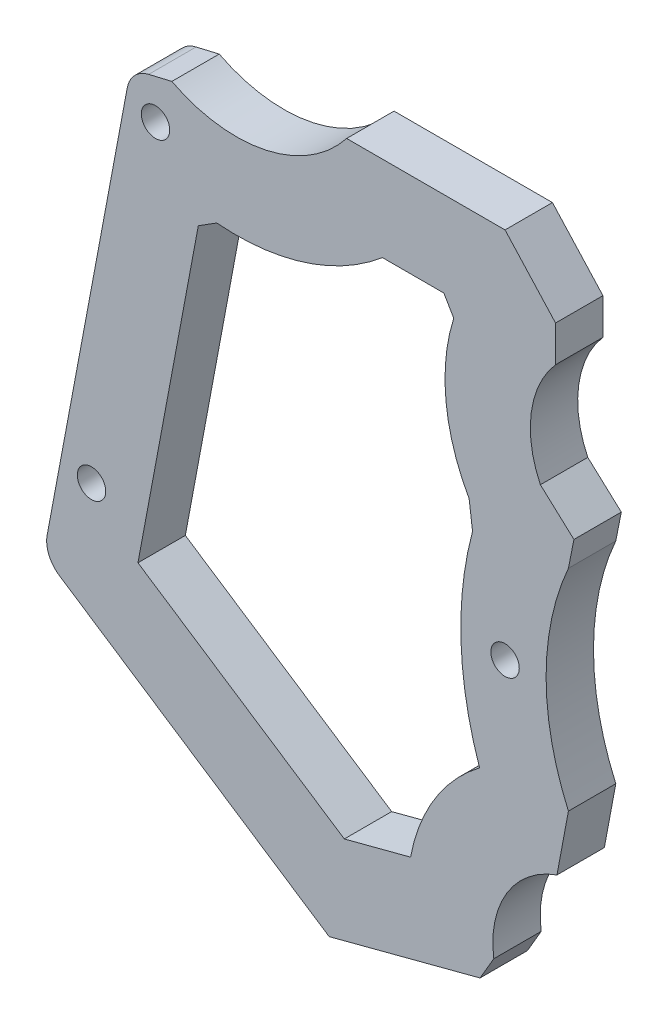
ISO-10303-21;
HEADER;
FILE_DESCRIPTION(('STEP AP214'),'2;1');
FILE_NAME('part.step','',(''),(''),'','','');
FILE_SCHEMA(('AUTOMOTIVE_DESIGN { 1 0 10303 214 1 1 1 1 }'));
ENDSEC;
DATA;
#1=APPLICATION_CONTEXT('core data for automotive mechanical design processes');
#2=APPLICATION_PROTOCOL_DEFINITION('international standard','automotive_design',2000,#1);
#3=PRODUCT_CONTEXT('',#1,'mechanical');
#4=PRODUCT('Part','Part','',(#3));
#5=PRODUCT_RELATED_PRODUCT_CATEGORY('part','',(#4));
#6=PRODUCT_DEFINITION_FORMATION('','',#4);
#7=PRODUCT_DEFINITION_CONTEXT('part definition',#1,'design');
#8=PRODUCT_DEFINITION('design','',#6,#7);
#9=PRODUCT_DEFINITION_SHAPE('','',#8);
#10=(LENGTH_UNIT() NAMED_UNIT(*) SI_UNIT(.MILLI.,.METRE.));
#11=(NAMED_UNIT(*) PLANE_ANGLE_UNIT() SI_UNIT($,.RADIAN.));
#12=(NAMED_UNIT(*) SI_UNIT($,.STERADIAN.) SOLID_ANGLE_UNIT());
#13=UNCERTAINTY_MEASURE_WITH_UNIT(LENGTH_MEASURE(1.E-05),#10,'distance_accuracy_value','');
#14=(GEOMETRIC_REPRESENTATION_CONTEXT(3) GLOBAL_UNCERTAINTY_ASSIGNED_CONTEXT((#13)) GLOBAL_UNIT_ASSIGNED_CONTEXT((#10,
#11,#12)) REPRESENTATION_CONTEXT('',''));
#15=CARTESIAN_POINT('',(0.,0.,0.));
#16=DIRECTION('',(0.,0.,1.));
#17=DIRECTION('',(1.,0.,0.));
#18=AXIS2_PLACEMENT_3D('',#15,#16,#17);
#19=CARTESIAN_POINT('',(45.7521152599476,-57.1963049716079,-24.5));
#20=DIRECTION('',(0.,0.,-1.));
#21=DIRECTION('',(-1.,0.,0.));
#22=AXIS2_PLACEMENT_3D('',#19,#20,#21);
#23=PLANE('',#22);
#24=CARTESIAN_POINT('',(-6.75260699696157,-36.3785967121409,-24.5));
#25=DIRECTION('',(0.,0.,1.));
#26=DIRECTION('',(1.,0.,0.));
#27=AXIS2_PLACEMENT_3D('',#24,#25,#26);
#28=CIRCLE('',#27,1.5);
#29=CARTESIAN_POINT('',(-5.25260699696157,-36.3785967121409,-24.5));
#30=VERTEX_POINT('',#29);
#31=EDGE_CURVE('E355',#30,#30,#28,.T.);
#32=ORIENTED_EDGE('',*,*,#31,.F.);
#33=EDGE_LOOP('',(#32));
#34=FACE_BOUND('',#33,.T.);
#35=CARTESIAN_POINT('',(36.8820128478495,-30.7199793016053,-24.5));
#36=DIRECTION('',(0.,0.,1.));
#37=DIRECTION('',(1.,0.,0.));
#38=AXIS2_PLACEMENT_3D('',#35,#36,#37);
#39=CIRCLE('',#38,1.5);
#40=CARTESIAN_POINT('',(38.3820128478495,-30.7199793016053,-24.5));
#41=VERTEX_POINT('',#40);
#42=EDGE_CURVE('E363',#41,#41,#39,.T.);
#43=ORIENTED_EDGE('',*,*,#42,.F.);
#44=EDGE_LOOP('',(#43));
#45=FACE_BOUND('',#44,.T.);
#46=CARTESIAN_POINT('',(0.,0.,-24.5));
#47=DIRECTION('',(0.,0.,1.));
#48=DIRECTION('',(1.,0.,0.));
#49=AXIS2_PLACEMENT_3D('',#46,#47,#48);
#50=CIRCLE('',#49,1.5);
#51=CARTESIAN_POINT('',(1.5,0.,-24.5));
#52=VERTEX_POINT('',#51);
#53=EDGE_CURVE('E371',#52,#52,#50,.T.);
#54=ORIENTED_EDGE('',*,*,#53,.F.);
#55=EDGE_LOOP('',(#54));
#56=FACE_BOUND('',#55,.T.);
#57=DIRECTION('',(0.967214376255356,0.2539613166704,0.));
#58=VECTOR('',#57,1.);
#59=CARTESIAN_POINT('',(18.3220080047089,-65.2757183813327,-24.5));
#60=LINE('',#59,#58);
#61=CARTESIAN_POINT('',(18.3220080047089,-65.2757183813327,-24.5));
#62=VERTEX_POINT('',#61);
#63=CARTESIAN_POINT('',(34.2420854292445,-61.0955863201418,-24.5));
#64=VERTEX_POINT('',#63);
#65=EDGE_CURVE('E391',#62,#64,#60,.T.);
#66=ORIENTED_EDGE('',*,*,#65,.T.);
#67=DIRECTION('',(-0.504346075134577,-0.863501613487982,0.));
#68=VECTOR('',#67,1.);
#69=CARTESIAN_POINT('',(35.692798529907,-58.6117896477953,-24.5));
#70=LINE('',#69,#68);
#71=CARTESIAN_POINT('',(35.692798529907,-58.6117896477953,-24.5));
#72=VERTEX_POINT('',#71);
#73=EDGE_CURVE('E11',#64,#72,#70,.F.);
#74=ORIENTED_EDGE('',*,*,#73,.T.);
#75=CARTESIAN_POINT('',(45.7521152599476,-57.1963049716079,-24.5));
#76=DIRECTION('',(0.,0.,-1.));
#77=DIRECTION('',(-1.,0.,0.));
#78=AXIS2_PLACEMENT_3D('',#75,#76,#77);
#79=CIRCLE('',#78,10.1584176889807);
#80=CARTESIAN_POINT('',(42.3607565447545,-47.6207038934154,-24.5));
#81=VERTEX_POINT('',#80);
#82=EDGE_CURVE('E394',#72,#81,#79,.T.);
#83=ORIENTED_EDGE('',*,*,#82,.T.);
#84=DIRECTION('',(0.184167668902795,0.982894841644268,0.));
#85=VECTOR('',#84,1.);
#86=CARTESIAN_POINT('',(42.3607565447545,-47.6207038934154,-24.5));
#87=LINE('',#86,#85);
#88=CARTESIAN_POINT('',(43.5670711053694,-41.1826555318728,-24.5));
#89=VERTEX_POINT('',#88);
#90=EDGE_CURVE('E397',#81,#89,#87,.T.);
#91=ORIENTED_EDGE('',*,*,#90,.T.);
#92=CARTESIAN_POINT('',(68.5341418125871,-30.0881510176377,-24.5));
#93=DIRECTION('',(0.,0.,-1.));
#94=DIRECTION('',(-1.,0.,0.));
#95=AXIS2_PLACEMENT_3D('',#92,#93,#94);
#96=CIRCLE('',#95,27.3211026518988);
#97=CARTESIAN_POINT('',(43.5670711053694,-18.9936465034026,-24.5));
#98=VERTEX_POINT('',#97);
#99=EDGE_CURVE('E400',#89,#98,#96,.T.);
#100=ORIENTED_EDGE('',*,*,#99,.T.);
#101=DIRECTION('',(0.194884067414608,0.980826284449973,0.));
#102=VECTOR('',#101,1.);
#103=CARTESIAN_POINT('',(44.148406248288,-16.0678619802585,-24.5));
#104=LINE('',#103,#102);
#105=CARTESIAN_POINT('',(44.148406248288,-16.0678619802585,-24.5));
#106=VERTEX_POINT('',#105);
#107=EDGE_CURVE('E403',#98,#106,#104,.T.);
#108=ORIENTED_EDGE('',*,*,#107,.T.);
#109=DIRECTION('',(-0.738485062438951,0.674269836604411,0.));
#110=VECTOR('',#109,1.);
#111=CARTESIAN_POINT('',(40.6104843344573,-12.837581298779,-24.5));
#112=LINE('',#111,#110);
#113=CARTESIAN_POINT('',(40.6104843344573,-12.837581298779,-24.5));
#114=VERTEX_POINT('',#113);
#115=EDGE_CURVE('E406',#106,#114,#112,.T.);
#116=ORIENTED_EDGE('',*,*,#115,.T.);
#117=CARTESIAN_POINT('',(50.3335706996791,-8.16785354829011,-24.5));
#118=DIRECTION('',(0.,0.,-1.));
#119=DIRECTION('',(-1.,0.,0.));
#120=AXIS2_PLACEMENT_3D('',#117,#118,#119);
#121=CIRCLE('',#120,10.7863230866337);
#122=CARTESIAN_POINT('',(42.2104974149201,-1.07134411479525,-24.5));
#123=VERTEX_POINT('',#122);
#124=EDGE_CURVE('E409',#114,#123,#121,.T.);
#125=ORIENTED_EDGE('',*,*,#124,.T.);
#126=DIRECTION('',(0.,1.,0.));
#127=VECTOR('',#126,1.);
#128=CARTESIAN_POINT('',(42.2104974149201,-1.07134411479525,-24.5));
#129=LINE('',#128,#127);
#130=CARTESIAN_POINT('',(42.2104974149201,2.74253966208223,-24.5));
#131=VERTEX_POINT('',#130);
#132=EDGE_CURVE('E412',#123,#131,#129,.T.);
#133=ORIENTED_EDGE('',*,*,#132,.T.);
#134=DIRECTION('',(-0.67385452874715,0.738864043032923,0.));
#135=VECTOR('',#134,1.);
#136=CARTESIAN_POINT('',(42.2104974149201,2.74253966208223,-24.5));
#137=LINE('',#136,#135);
#138=CARTESIAN_POINT('',(36.8820128478495,8.58508502240518,-24.5));
#139=VERTEX_POINT('',#138);
#140=EDGE_CURVE('E415',#131,#139,#137,.T.);
#141=ORIENTED_EDGE('',*,*,#140,.T.);
#142=DIRECTION('',(-1.,0.,0.));
#143=VECTOR('',#142,1.);
#144=CARTESIAN_POINT('',(36.8820128478495,8.58508502240518,-24.5));
#145=LINE('',#144,#143);
#146=CARTESIAN_POINT('',(20.1673375364657,8.58508502240517,-24.5));
#147=VERTEX_POINT('',#146);
#148=EDGE_CURVE('E418',#139,#147,#145,.T.);
#149=ORIENTED_EDGE('',*,*,#148,.T.);
#150=CARTESIAN_POINT('',(8.52214887609179,17.7285910662128,-24.5));
#151=DIRECTION('',(0.,0.,-1.));
#152=DIRECTION('',(1.,0.,0.));
#153=AXIS2_PLACEMENT_3D('',#150,#151,#152);
#154=CIRCLE('',#153,14.8058813215846);
#155=CARTESIAN_POINT('',(1.72371106216177,4.57582082572835,-24.5));
#156=VERTEX_POINT('',#155);
#157=EDGE_CURVE('E421',#147,#156,#154,.T.);
#158=ORIENTED_EDGE('',*,*,#157,.T.);
#159=DIRECTION('',(-0.973228722146312,-0.229838757370155,0.));
#160=VECTOR('',#159,1.);
#161=CARTESIAN_POINT('',(1.72371106216178,4.57582082572835,-24.5));
#162=LINE('',#161,#160);
#163=CARTESIAN_POINT('',(-0.724935331308892,3.99754582057534,-24.5));
#164=VERTEX_POINT('',#163);
#165=EDGE_CURVE('E379',#156,#164,#162,.T.);
#166=ORIENTED_EDGE('',*,*,#165,.T.);
#167=CARTESIAN_POINT('',(-0.0354190591984263,1.07785965413641,-24.5));
#168=DIRECTION('',(0.,0.,-1.));
#169=DIRECTION('',(-1.,0.,0.));
#170=AXIS2_PLACEMENT_3D('',#167,#168,#169);
#171=CIRCLE('',#170,3.);
#172=CARTESIAN_POINT('',(-2.98410358413123,1.6303626608448,-24.5));
#173=VERTEX_POINT('',#172);
#174=EDGE_CURVE('E529',#164,#173,#171,.F.);
#175=ORIENTED_EDGE('',*,*,#174,.T.);
#176=DIRECTION('',(-0.184167668902796,-0.982894841644268,0.));
#177=VECTOR('',#176,1.);
#178=CARTESIAN_POINT('',(-2.6246193538371,3.54891436817542,-24.5));
#179=LINE('',#178,#177);
#180=CARTESIAN_POINT('',(-11.4339456486537,-43.4660770530739,-24.5));
#181=VERTEX_POINT('',#180);
#182=EDGE_CURVE('E383',#173,#181,#179,.T.);
#183=ORIENTED_EDGE('',*,*,#182,.T.);
#184=CARTESIAN_POINT('',(-8.48526112372088,-44.0185800597823,-24.5));
#185=DIRECTION('',(0.,0.,-1.));
#186=DIRECTION('',(-1.,0.,0.));
#187=AXIS2_PLACEMENT_3D('',#184,#185,#186);
#188=CIRCLE('',#187,3.);
#189=CARTESIAN_POINT('',(-10.1359383462551,-46.5236279050353,-24.5));
#190=VERTEX_POINT('',#189);
#191=EDGE_CURVE('E526',#181,#190,#188,.F.);
#192=ORIENTED_EDGE('',*,*,#191,.T.);
#193=DIRECTION('',(0.835015948417661,-0.55022574084475,0.));
#194=VECTOR('',#193,1.);
#195=CARTESIAN_POINT('',(-11.8012370537715,-45.4262953129963,-24.5));
#196=LINE('',#195,#194);
#197=EDGE_CURVE('E388',#190,#62,#196,.T.);
#198=ORIENTED_EDGE('',*,*,#197,.T.);
#199=EDGE_LOOP('',(#66,#74,#83,#91,#100,#108,#116,#125,#133,#141,#149,#158,#166,#175,#183,#192,#198));
#200=FACE_BOUND('',#199,.T.);
#201=DIRECTION('',(-0.184167668902796,-0.982894841644268,0.));
#202=VECTOR('',#201,1.);
#203=CARTESIAN_POINT('',(4.51444522255319,-7.21872071954092,-24.5));
#204=LINE('',#203,#202);
#205=CARTESIAN_POINT('',(4.51444522255319,-7.21872071954092,-24.5));
#206=VERTEX_POINT('',#205);
#207=CARTESIAN_POINT('',(-1.85330926361958,-41.2031495533542,-24.5));
#208=VERTEX_POINT('',#207);
#209=EDGE_CURVE('E231',#206,#208,#204,.T.);
#210=ORIENTED_EDGE('',*,*,#209,.F.);
#211=DIRECTION('',(-0.845658272413689,-0.533724728955194,0.));
#212=VECTOR('',#211,1.);
#213=CARTESIAN_POINT('',(4.51444522255319,-7.21872071954092,-24.5));
#214=LINE('',#213,#212);
#215=CARTESIAN_POINT('',(6.46418631623943,-5.98817042433677,-24.5));
#216=VERTEX_POINT('',#215);
#217=EDGE_CURVE('E284',#216,#206,#214,.T.);
#218=ORIENTED_EDGE('',*,*,#217,.F.);
#219=CARTESIAN_POINT('',(8.52214887609179,17.7285910662128,-24.5));
#220=DIRECTION('',(0.,0.,-1.));
#221=DIRECTION('',(1.,0.,0.));
#222=AXIS2_PLACEMENT_3D('',#219,#220,#221);
#223=CIRCLE('',#222,23.8058813215846);
#224=CARTESIAN_POINT('',(23.9342601505306,-0.414914977594823,-24.5));
#225=VERTEX_POINT('',#224);
#226=EDGE_CURVE('E280',#225,#216,#223,.T.);
#227=ORIENTED_EDGE('',*,*,#226,.F.);
#228=DIRECTION('',(-1.,0.,0.));
#229=VECTOR('',#228,1.);
#230=CARTESIAN_POINT('',(30.4304924010898,-0.414914977594824,-24.5));
#231=LINE('',#230,#229);
#232=CARTESIAN_POINT('',(30.4304924010898,-0.414914977594824,-24.5));
#233=VERTEX_POINT('',#232);
#234=EDGE_CURVE('E277',#233,#225,#231,.T.);
#235=ORIENTED_EDGE('',*,*,#234,.F.);
#236=DIRECTION('',(-0.503327141673234,0.864095937066627,0.));
#237=VECTOR('',#236,1.);
#238=CARTESIAN_POINT('',(30.4304924010898,-0.414914977594824,-24.5));
#239=LINE('',#238,#237);
#240=CARTESIAN_POINT('',(31.4692590914865,-2.19823640498308,-24.5));
#241=VERTEX_POINT('',#240);
#242=EDGE_CURVE('E274',#241,#233,#239,.T.);
#243=ORIENTED_EDGE('',*,*,#242,.F.);
#244=CARTESIAN_POINT('',(50.3335706996791,-8.16785354829011,-24.5));
#245=DIRECTION('',(0.,0.,-1.));
#246=DIRECTION('',(-1.,0.,0.));
#247=AXIS2_PLACEMENT_3D('',#244,#245,#246);
#248=CIRCLE('',#247,19.7863230866337);
#249=CARTESIAN_POINT('',(33.092400061795,-17.8756141718334,-24.5));
#250=VERTEX_POINT('',#249);
#251=EDGE_CURVE('E271',#250,#241,#248,.T.);
#252=ORIENTED_EDGE('',*,*,#251,.F.);
#253=DIRECTION('',(-0.127358194611711,0.991856789191487,0.));
#254=VECTOR('',#253,1.);
#255=CARTESIAN_POINT('',(33.452553095621,-20.6804610278788,-24.5));
#256=LINE('',#255,#254);
#257=CARTESIAN_POINT('',(33.452553095621,-20.6804610278788,-24.5));
#258=VERTEX_POINT('',#257);
#259=EDGE_CURVE('E268',#258,#250,#256,.T.);
#260=ORIENTED_EDGE('',*,*,#259,.F.);
#261=CARTESIAN_POINT('',(68.5341418125871,-30.0881510176377,-24.5));
#262=DIRECTION('',(0.,0.,-1.));
#263=DIRECTION('',(-1.,0.,0.));
#264=AXIS2_PLACEMENT_3D('',#261,#262,#263);
#265=CIRCLE('',#264,36.3211026518988);
#266=CARTESIAN_POINT('',(34.1933789328377,-41.9175424933899,-24.5));
#267=VERTEX_POINT('',#266);
#268=EDGE_CURVE('E265',#267,#258,#265,.T.);
#269=ORIENTED_EDGE('',*,*,#268,.F.);
#270=CARTESIAN_POINT('',(45.7521152599476,-57.1963049716079,-24.5));
#271=DIRECTION('',(0.,0.,-1.));
#272=DIRECTION('',(-1.,0.,0.));
#273=AXIS2_PLACEMENT_3D('',#270,#271,#272);
#274=CIRCLE('',#273,19.1584176889807);
#275=CARTESIAN_POINT('',(26.9126486312118,-53.7150027023126,-24.5));
#276=VERTEX_POINT('',#275);
#277=EDGE_CURVE('E260',#276,#267,#274,.T.);
#278=ORIENTED_EDGE('',*,*,#277,.F.);
#279=DIRECTION('',(0.967214376255356,0.253961316670401,0.));
#280=VECTOR('',#279,1.);
#281=CARTESIAN_POINT('',(19.9206496621183,-55.5508906997841,-24.5));
#282=LINE('',#281,#280);
#283=CARTESIAN_POINT('',(19.9206496621183,-55.5508906997841,-24.5));
#284=VERTEX_POINT('',#283);
#285=EDGE_CURVE('E256',#284,#276,#282,.T.);
#286=ORIENTED_EDGE('',*,*,#285,.F.);
#287=DIRECTION('',(0.835015948417661,-0.55022574084475,0.));
#288=VECTOR('',#287,1.);
#289=CARTESIAN_POINT('',(-1.85330926361958,-41.2031495533542,-24.5));
#290=LINE('',#289,#288);
#291=EDGE_CURVE('E242',#208,#284,#290,.T.);
#292=ORIENTED_EDGE('',*,*,#291,.F.);
#293=EDGE_LOOP('',(#210,#218,#227,#235,#243,#252,#260,#269,#278,#286,#292));
#294=FACE_BOUND('',#293,.T.);
#295=ADVANCED_FACE('F43',(#34,#45,#56,#200,#294),#23,.F.);
#296=CARTESIAN_POINT('',(45.7521152599476,-57.1963049716079,-29.5));
#297=DIRECTION('',(0.,0.,-1.));
#298=DIRECTION('',(-1.,0.,0.));
#299=AXIS2_PLACEMENT_3D('',#296,#297,#298);
#300=PLANE('',#299);
#301=CARTESIAN_POINT('',(36.8820128478495,-30.7199793016053,-29.5));
#302=DIRECTION('',(0.,0.,1.));
#303=DIRECTION('',(1.,0.,0.));
#304=AXIS2_PLACEMENT_3D('',#301,#302,#303);
#305=CIRCLE('',#304,1.5);
#306=CARTESIAN_POINT('',(38.3820128478495,-30.7199793016053,-29.5));
#307=VERTEX_POINT('',#306);
#308=EDGE_CURVE('E359',#307,#307,#305,.T.);
#309=ORIENTED_EDGE('',*,*,#308,.T.);
#310=EDGE_LOOP('',(#309));
#311=FACE_BOUND('',#310,.T.);
#312=CARTESIAN_POINT('',(45.7521152599476,-57.1963049716079,-29.5));
#313=DIRECTION('',(0.,0.,-1.));
#314=DIRECTION('',(-1.,0.,0.));
#315=AXIS2_PLACEMENT_3D('',#312,#313,#314);
#316=CIRCLE('',#315,10.1584176889807);
#317=CARTESIAN_POINT('',(35.692798529907,-58.6117896477953,-29.5));
#318=VERTEX_POINT('',#317);
#319=CARTESIAN_POINT('',(42.3607565447545,-47.6207038934154,-29.5));
#320=VERTEX_POINT('',#319);
#321=EDGE_CURVE('E438',#318,#320,#316,.T.);
#322=ORIENTED_EDGE('',*,*,#321,.F.);
#323=DIRECTION('',(0.504346075134577,0.863501613487982,0.));
#324=VECTOR('',#323,1.);
#325=CARTESIAN_POINT('',(38.8679850052976,-53.1754855308388,-29.5));
#326=LINE('',#325,#324);
#327=CARTESIAN_POINT('',(34.2420854292445,-61.0955863201418,-29.5));
#328=VERTEX_POINT('',#327);
#329=EDGE_CURVE('E67',#318,#328,#326,.F.);
#330=ORIENTED_EDGE('',*,*,#329,.T.);
#331=DIRECTION('',(0.967214376255356,0.2539613166704,0.));
#332=VECTOR('',#331,1.);
#333=CARTESIAN_POINT('',(18.3220080047089,-65.2757183813327,-29.5));
#334=LINE('',#333,#332);
#335=CARTESIAN_POINT('',(18.3220080047089,-65.2757183813327,-29.5));
#336=VERTEX_POINT('',#335);
#337=EDGE_CURVE('E435',#336,#328,#334,.T.);
#338=ORIENTED_EDGE('',*,*,#337,.F.);
#339=DIRECTION('',(0.835015948417661,-0.55022574084475,0.));
#340=VECTOR('',#339,1.);
#341=CARTESIAN_POINT('',(-11.8012370537715,-45.4262953129963,-29.5));
#342=LINE('',#341,#340);
#343=CARTESIAN_POINT('',(-10.1359383462551,-46.5236279050353,-29.5));
#344=VERTEX_POINT('',#343);
#345=EDGE_CURVE('E432',#344,#336,#342,.T.);
#346=ORIENTED_EDGE('',*,*,#345,.F.);
#347=CARTESIAN_POINT('',(-8.48526112372088,-44.0185800597823,-29.5));
#348=DIRECTION('',(0.,0.,-1.));
#349=DIRECTION('',(-1.,0.,0.));
#350=AXIS2_PLACEMENT_3D('',#347,#348,#349);
#351=CIRCLE('',#350,3.);
#352=CARTESIAN_POINT('',(-11.4339456486537,-43.4660770530739,-29.5));
#353=VERTEX_POINT('',#352);
#354=EDGE_CURVE('E517',#344,#353,#351,.T.);
#355=ORIENTED_EDGE('',*,*,#354,.T.);
#356=DIRECTION('',(-0.184167668902796,-0.982894841644268,0.));
#357=VECTOR('',#356,1.);
#358=CARTESIAN_POINT('',(-2.6246193538371,3.54891436817542,-29.5));
#359=LINE('',#358,#357);
#360=CARTESIAN_POINT('',(-2.98410358413123,1.6303626608448,-29.5));
#361=VERTEX_POINT('',#360);
#362=EDGE_CURVE('E428',#361,#353,#359,.T.);
#363=ORIENTED_EDGE('',*,*,#362,.F.);
#364=CARTESIAN_POINT('',(-0.0354190591984263,1.07785965413641,-29.5));
#365=DIRECTION('',(0.,0.,-1.));
#366=DIRECTION('',(-1.,0.,0.));
#367=AXIS2_PLACEMENT_3D('',#364,#365,#366);
#368=CIRCLE('',#367,3.);
#369=CARTESIAN_POINT('',(-0.724935331308892,3.99754582057534,-29.5));
#370=VERTEX_POINT('',#369);
#371=EDGE_CURVE('E520',#361,#370,#368,.T.);
#372=ORIENTED_EDGE('',*,*,#371,.T.);
#373=DIRECTION('',(-0.973228722146312,-0.229838757370155,0.));
#374=VECTOR('',#373,1.);
#375=CARTESIAN_POINT('',(1.72371106216178,4.57582082572835,-29.5));
#376=LINE('',#375,#374);
#377=CARTESIAN_POINT('',(1.72371106216177,4.57582082572835,-29.5));
#378=VERTEX_POINT('',#377);
#379=EDGE_CURVE('E375',#378,#370,#376,.T.);
#380=ORIENTED_EDGE('',*,*,#379,.F.);
#381=CARTESIAN_POINT('',(8.52214887609179,17.7285910662128,-29.5));
#382=DIRECTION('',(0.,0.,-1.));
#383=DIRECTION('',(1.,0.,0.));
#384=AXIS2_PLACEMENT_3D('',#381,#382,#383);
#385=CIRCLE('',#384,14.8058813215846);
#386=CARTESIAN_POINT('',(20.1673375364657,8.58508502240517,-29.5));
#387=VERTEX_POINT('',#386);
#388=EDGE_CURVE('E384',#387,#378,#385,.T.);
#389=ORIENTED_EDGE('',*,*,#388,.F.);
#390=DIRECTION('',(-1.,0.,0.));
#391=VECTOR('',#390,1.);
#392=CARTESIAN_POINT('',(36.8820128478495,8.58508502240518,-29.5));
#393=LINE('',#392,#391);
#394=CARTESIAN_POINT('',(36.8820128478495,8.58508502240518,-29.5));
#395=VERTEX_POINT('',#394);
#396=EDGE_CURVE('E462',#395,#387,#393,.T.);
#397=ORIENTED_EDGE('',*,*,#396,.F.);
#398=DIRECTION('',(-0.67385452874715,0.738864043032923,0.));
#399=VECTOR('',#398,1.);
#400=CARTESIAN_POINT('',(42.2104974149201,2.74253966208223,-29.5));
#401=LINE('',#400,#399);
#402=CARTESIAN_POINT('',(42.2104974149201,2.74253966208223,-29.5));
#403=VERTEX_POINT('',#402);
#404=EDGE_CURVE('E459',#403,#395,#401,.T.);
#405=ORIENTED_EDGE('',*,*,#404,.F.);
#406=DIRECTION('',(0.,1.,0.));
#407=VECTOR('',#406,1.);
#408=CARTESIAN_POINT('',(42.2104974149201,-1.07134411479525,-29.5));
#409=LINE('',#408,#407);
#410=CARTESIAN_POINT('',(42.2104974149201,-1.07134411479525,-29.5));
#411=VERTEX_POINT('',#410);
#412=EDGE_CURVE('E456',#411,#403,#409,.T.);
#413=ORIENTED_EDGE('',*,*,#412,.F.);
#414=CARTESIAN_POINT('',(50.3335706996791,-8.16785354829011,-29.5));
#415=DIRECTION('',(0.,0.,-1.));
#416=DIRECTION('',(-1.,0.,0.));
#417=AXIS2_PLACEMENT_3D('',#414,#415,#416);
#418=CIRCLE('',#417,10.7863230866337);
#419=CARTESIAN_POINT('',(40.6104843344573,-12.837581298779,-29.5));
#420=VERTEX_POINT('',#419);
#421=EDGE_CURVE('E453',#420,#411,#418,.T.);
#422=ORIENTED_EDGE('',*,*,#421,.F.);
#423=DIRECTION('',(-0.738485062438951,0.674269836604411,0.));
#424=VECTOR('',#423,1.);
#425=CARTESIAN_POINT('',(40.6104843344573,-12.837581298779,-29.5));
#426=LINE('',#425,#424);
#427=CARTESIAN_POINT('',(44.148406248288,-16.0678619802585,-29.5));
#428=VERTEX_POINT('',#427);
#429=EDGE_CURVE('E450',#428,#420,#426,.T.);
#430=ORIENTED_EDGE('',*,*,#429,.F.);
#431=DIRECTION('',(0.194884067414608,0.980826284449973,0.));
#432=VECTOR('',#431,1.);
#433=CARTESIAN_POINT('',(44.148406248288,-16.0678619802585,-29.5));
#434=LINE('',#433,#432);
#435=CARTESIAN_POINT('',(43.5670711053694,-18.9936465034026,-29.5));
#436=VERTEX_POINT('',#435);
#437=EDGE_CURVE('E447',#436,#428,#434,.T.);
#438=ORIENTED_EDGE('',*,*,#437,.F.);
#439=CARTESIAN_POINT('',(68.5341418125871,-30.0881510176377,-29.5));
#440=DIRECTION('',(0.,0.,-1.));
#441=DIRECTION('',(-1.,0.,0.));
#442=AXIS2_PLACEMENT_3D('',#439,#440,#441);
#443=CIRCLE('',#442,27.3211026518988);
#444=CARTESIAN_POINT('',(43.5670711053694,-41.1826555318728,-29.5));
#445=VERTEX_POINT('',#444);
#446=EDGE_CURVE('E444',#445,#436,#443,.T.);
#447=ORIENTED_EDGE('',*,*,#446,.F.);
#448=DIRECTION('',(0.184167668902795,0.982894841644268,0.));
#449=VECTOR('',#448,1.);
#450=CARTESIAN_POINT('',(42.3607565447545,-47.6207038934154,-29.5));
#451=LINE('',#450,#449);
#452=EDGE_CURVE('E441',#320,#445,#451,.T.);
#453=ORIENTED_EDGE('',*,*,#452,.F.);
#454=EDGE_LOOP('',(#322,#330,#338,#346,#355,#363,#372,#380,#389,#397,#405,#413,#422,#430,#438,
#447,#453));
#455=FACE_BOUND('',#454,.T.);
#456=CARTESIAN_POINT('',(0.,0.,-29.5));
#457=DIRECTION('',(0.,0.,1.));
#458=DIRECTION('',(1.,0.,0.));
#459=AXIS2_PLACEMENT_3D('',#456,#457,#458);
#460=CIRCLE('',#459,1.5);
#461=CARTESIAN_POINT('',(1.5,0.,-29.5));
#462=VERTEX_POINT('',#461);
#463=EDGE_CURVE('E367',#462,#462,#460,.T.);
#464=ORIENTED_EDGE('',*,*,#463,.T.);
#465=EDGE_LOOP('',(#464));
#466=FACE_BOUND('',#465,.T.);
#467=CARTESIAN_POINT('',(-6.75260699696157,-36.3785967121409,-29.5));
#468=DIRECTION('',(0.,0.,1.));
#469=DIRECTION('',(1.,0.,0.));
#470=AXIS2_PLACEMENT_3D('',#467,#468,#469);
#471=CIRCLE('',#470,1.5);
#472=CARTESIAN_POINT('',(-5.25260699696157,-36.3785967121409,-29.5));
#473=VERTEX_POINT('',#472);
#474=EDGE_CURVE('E251',#473,#473,#471,.T.);
#475=ORIENTED_EDGE('',*,*,#474,.T.);
#476=EDGE_LOOP('',(#475));
#477=FACE_BOUND('',#476,.T.);
#478=DIRECTION('',(-0.845658272413689,-0.533724728955194,0.));
#479=VECTOR('',#478,1.);
#480=CARTESIAN_POINT('',(4.51444522255319,-7.21872071954092,-29.5));
#481=LINE('',#480,#479);
#482=CARTESIAN_POINT('',(6.46418631623943,-5.98817042433677,-29.5));
#483=VERTEX_POINT('',#482);
#484=CARTESIAN_POINT('',(4.51444522255319,-7.21872071954092,-29.5));
#485=VERTEX_POINT('',#484);
#486=EDGE_CURVE('E243',#483,#485,#481,.T.);
#487=ORIENTED_EDGE('',*,*,#486,.T.);
#488=DIRECTION('',(-0.184167668902796,-0.982894841644268,0.));
#489=VECTOR('',#488,1.);
#490=CARTESIAN_POINT('',(4.51444522255319,-7.21872071954092,-29.5));
#491=LINE('',#490,#489);
#492=CARTESIAN_POINT('',(-1.85330926361958,-41.2031495533542,-29.5));
#493=VERTEX_POINT('',#492);
#494=EDGE_CURVE('E287',#485,#493,#491,.T.);
#495=ORIENTED_EDGE('',*,*,#494,.T.);
#496=DIRECTION('',(0.835015948417661,-0.55022574084475,0.));
#497=VECTOR('',#496,1.);
#498=CARTESIAN_POINT('',(-1.85330926361958,-41.2031495533542,-29.5));
#499=LINE('',#498,#497);
#500=CARTESIAN_POINT('',(19.9206496621183,-55.5508906997841,-29.5));
#501=VERTEX_POINT('',#500);
#502=EDGE_CURVE('E249',#493,#501,#499,.T.);
#503=ORIENTED_EDGE('',*,*,#502,.T.);
#504=DIRECTION('',(0.967214376255356,0.253961316670401,0.));
#505=VECTOR('',#504,1.);
#506=CARTESIAN_POINT('',(19.9206496621183,-55.5508906997841,-29.5));
#507=LINE('',#506,#505);
#508=CARTESIAN_POINT('',(26.9126486312118,-53.7150027023126,-29.5));
#509=VERTEX_POINT('',#508);
#510=EDGE_CURVE('E292',#501,#509,#507,.T.);
#511=ORIENTED_EDGE('',*,*,#510,.T.);
#512=CARTESIAN_POINT('',(45.7521152599476,-57.1963049716079,-29.5));
#513=DIRECTION('',(0.,0.,-1.));
#514=DIRECTION('',(-1.,0.,0.));
#515=AXIS2_PLACEMENT_3D('',#512,#513,#514);
#516=CIRCLE('',#515,19.1584176889807);
#517=CARTESIAN_POINT('',(34.1933789328377,-41.9175424933899,-29.5));
#518=VERTEX_POINT('',#517);
#519=EDGE_CURVE('E296',#509,#518,#516,.T.);
#520=ORIENTED_EDGE('',*,*,#519,.T.);
#521=CARTESIAN_POINT('',(68.5341418125871,-30.0881510176377,-29.5));
#522=DIRECTION('',(0.,0.,-1.));
#523=DIRECTION('',(-1.,0.,0.));
#524=AXIS2_PLACEMENT_3D('',#521,#522,#523);
#525=CIRCLE('',#524,36.3211026518988);
#526=CARTESIAN_POINT('',(33.452553095621,-20.6804610278788,-29.5));
#527=VERTEX_POINT('',#526);
#528=EDGE_CURVE('E300',#518,#527,#525,.T.);
#529=ORIENTED_EDGE('',*,*,#528,.T.);
#530=DIRECTION('',(-0.127358194611711,0.991856789191487,0.));
#531=VECTOR('',#530,1.);
#532=CARTESIAN_POINT('',(33.452553095621,-20.6804610278788,-29.5));
#533=LINE('',#532,#531);
#534=CARTESIAN_POINT('',(33.092400061795,-17.8756141718334,-29.5));
#535=VERTEX_POINT('',#534);
#536=EDGE_CURVE('E304',#527,#535,#533,.T.);
#537=ORIENTED_EDGE('',*,*,#536,.T.);
#538=CARTESIAN_POINT('',(50.3335706996791,-8.16785354829011,-29.5));
#539=DIRECTION('',(0.,0.,-1.));
#540=DIRECTION('',(-1.,0.,0.));
#541=AXIS2_PLACEMENT_3D('',#538,#539,#540);
#542=CIRCLE('',#541,19.7863230866337);
#543=CARTESIAN_POINT('',(31.4692590914865,-2.19823640498308,-29.5));
#544=VERTEX_POINT('',#543);
#545=EDGE_CURVE('E308',#535,#544,#542,.T.);
#546=ORIENTED_EDGE('',*,*,#545,.T.);
#547=DIRECTION('',(-0.503327141673234,0.864095937066627,0.));
#548=VECTOR('',#547,1.);
#549=CARTESIAN_POINT('',(30.4304924010898,-0.414914977594824,-29.5));
#550=LINE('',#549,#548);
#551=CARTESIAN_POINT('',(30.4304924010898,-0.414914977594824,-29.5));
#552=VERTEX_POINT('',#551);
#553=EDGE_CURVE('E312',#544,#552,#550,.T.);
#554=ORIENTED_EDGE('',*,*,#553,.T.);
#555=DIRECTION('',(-1.,0.,0.));
#556=VECTOR('',#555,1.);
#557=CARTESIAN_POINT('',(30.4304924010898,-0.414914977594824,-29.5));
#558=LINE('',#557,#556);
#559=CARTESIAN_POINT('',(23.9342601505306,-0.414914977594823,-29.5));
#560=VERTEX_POINT('',#559);
#561=EDGE_CURVE('E316',#552,#560,#558,.T.);
#562=ORIENTED_EDGE('',*,*,#561,.T.);
#563=CARTESIAN_POINT('',(8.52214887609179,17.7285910662128,-29.5));
#564=DIRECTION('',(0.,0.,-1.));
#565=DIRECTION('',(1.,0.,0.));
#566=AXIS2_PLACEMENT_3D('',#563,#564,#565);
#567=CIRCLE('',#566,23.8058813215846);
#568=EDGE_CURVE('E320',#560,#483,#567,.T.);
#569=ORIENTED_EDGE('',*,*,#568,.T.);
#570=EDGE_LOOP('',(#487,#495,#503,#511,#520,#529,#537,#546,#554,#562,#569));
#571=FACE_BOUND('',#570,.T.);
#572=ADVANCED_FACE('F550',(#311,#455,#466,#477,#571),#300,.T.);
#573=CARTESIAN_POINT('',(1.72371106216178,4.57582082572835,-24.5));
#574=DIRECTION('',(0.229838757370155,-0.973228722146312,0.));
#575=DIRECTION('',(0.973228722146312,0.229838757370155,0.));
#576=AXIS2_PLACEMENT_3D('',#573,#574,#575);
#577=PLANE('',#576);
#578=ORIENTED_EDGE('',*,*,#379,.T.);
#579=DIRECTION('',(0.,0.,-1.));
#580=VECTOR('',#579,1.);
#581=CARTESIAN_POINT('',(-0.724935331308892,3.99754582057534,-24.5));
#582=LINE('',#581,#580);
#583=EDGE_CURVE('E523',#370,#164,#582,.F.);
#584=ORIENTED_EDGE('',*,*,#583,.T.);
#585=ORIENTED_EDGE('',*,*,#165,.F.);
#586=DIRECTION('',(0.,0.,-1.));
#587=VECTOR('',#586,1.);
#588=CARTESIAN_POINT('',(1.72371106216177,4.57582082572835,-24.5));
#589=LINE('',#588,#587);
#590=EDGE_CURVE('E424',#156,#378,#589,.T.);
#591=ORIENTED_EDGE('',*,*,#590,.T.);
#592=EDGE_LOOP('',(#578,#584,#585,#591));
#593=FACE_BOUND('',#592,.T.);
#594=ADVANCED_FACE('F578',(#593),#577,.F.);
#595=CARTESIAN_POINT('',(-2.6246193538371,3.54891436817542,-24.5));
#596=DIRECTION('',(0.982894841644268,-0.184167668902796,0.));
#597=DIRECTION('',(0.184167668902796,0.982894841644268,0.));
#598=AXIS2_PLACEMENT_3D('',#595,#596,#597);
#599=PLANE('',#598);
#600=ORIENTED_EDGE('',*,*,#182,.F.);
#601=DIRECTION('',(0.,0.,-1.));
#602=VECTOR('',#601,1.);
#603=CARTESIAN_POINT('',(-2.98410358413123,1.6303626608448,-24.5));
#604=LINE('',#603,#602);
#605=EDGE_CURVE('E513',#173,#361,#604,.T.);
#606=ORIENTED_EDGE('',*,*,#605,.T.);
#607=ORIENTED_EDGE('',*,*,#362,.T.);
#608=DIRECTION('',(0.,0.,-1.));
#609=VECTOR('',#608,1.);
#610=CARTESIAN_POINT('',(-11.4339456486537,-43.4660770530739,-24.5));
#611=LINE('',#610,#609);
#612=EDGE_CURVE('E510',#353,#181,#611,.F.);
#613=ORIENTED_EDGE('',*,*,#612,.T.);
#614=EDGE_LOOP('',(#600,#606,#607,#613));
#615=FACE_BOUND('',#614,.T.);
#616=ADVANCED_FACE('F627',(#615),#599,.F.);
#617=CARTESIAN_POINT('',(-11.8012370537715,-45.4262953129963,-24.5));
#618=DIRECTION('',(0.55022574084475,0.835015948417661,0.));
#619=DIRECTION('',(-0.835015948417661,0.55022574084475,0.));
#620=AXIS2_PLACEMENT_3D('',#617,#618,#619);
#621=PLANE('',#620);
#622=ORIENTED_EDGE('',*,*,#197,.F.);
#623=DIRECTION('',(0.,0.,-1.));
#624=VECTOR('',#623,1.);
#625=CARTESIAN_POINT('',(-10.1359383462551,-46.5236279050353,-24.5));
#626=LINE('',#625,#624);
#627=EDGE_CURVE('E532',#190,#344,#626,.T.);
#628=ORIENTED_EDGE('',*,*,#627,.T.);
#629=ORIENTED_EDGE('',*,*,#345,.T.);
#630=DIRECTION('',(0.,0.,-1.));
#631=VECTOR('',#630,1.);
#632=CARTESIAN_POINT('',(18.3220080047089,-65.2757183813327,-24.5));
#633=LINE('',#632,#631);
#634=EDGE_CURVE('E506',#62,#336,#633,.T.);
#635=ORIENTED_EDGE('',*,*,#634,.F.);
#636=EDGE_LOOP('',(#622,#628,#629,#635));
#637=FACE_BOUND('',#636,.T.);
#638=ADVANCED_FACE('F624',(#637),#621,.F.);
#639=CARTESIAN_POINT('',(18.3220080047089,-65.2757183813327,-24.5));
#640=DIRECTION('',(-0.2539613166704,0.967214376255356,0.));
#641=DIRECTION('',(-0.967214376255356,-0.253961316670401,0.));
#642=AXIS2_PLACEMENT_3D('',#639,#640,#641);
#643=PLANE('',#642);
#644=ORIENTED_EDGE('',*,*,#337,.T.);
#645=DIRECTION('',(0.,0.,1.));
#646=VECTOR('',#645,1.);
#647=CARTESIAN_POINT('',(34.2420854292445,-61.0955863201418,-24.5));
#648=LINE('',#647,#646);
#649=EDGE_CURVE('E53',#328,#64,#648,.T.);
#650=ORIENTED_EDGE('',*,*,#649,.T.);
#651=ORIENTED_EDGE('',*,*,#65,.F.);
#652=ORIENTED_EDGE('',*,*,#634,.T.);
#653=EDGE_LOOP('',(#644,#650,#651,#652));
#654=FACE_BOUND('',#653,.T.);
#655=ADVANCED_FACE('F621',(#654),#643,.F.);
#656=CARTESIAN_POINT('',(45.7521152599476,-57.1963049716079,-24.5));
#657=DIRECTION('',(0.,0.,-1.));
#658=DIRECTION('',(-1.,0.,0.));
#659=AXIS2_PLACEMENT_3D('',#656,#657,#658);
#660=CYLINDRICAL_SURFACE('',#659,10.1584176889807);
#661=ORIENTED_EDGE('',*,*,#82,.F.);
#662=DIRECTION('',(0.,0.,-1.));
#663=VECTOR('',#662,1.);
#664=CARTESIAN_POINT('',(35.692798529907,-58.6117896477953,-24.5));
#665=LINE('',#664,#663);
#666=EDGE_CURVE('E536',#72,#318,#665,.T.);
#667=ORIENTED_EDGE('',*,*,#666,.T.);
#668=ORIENTED_EDGE('',*,*,#321,.T.);
#669=DIRECTION('',(0.,0.,-1.));
#670=VECTOR('',#669,1.);
#671=CARTESIAN_POINT('',(42.3607565447545,-47.6207038934154,-24.5));
#672=LINE('',#671,#670);
#673=EDGE_CURVE('E502',#81,#320,#672,.T.);
#674=ORIENTED_EDGE('',*,*,#673,.F.);
#675=EDGE_LOOP('',(#661,#667,#668,#674));
#676=FACE_BOUND('',#675,.T.);
#677=ADVANCED_FACE('F545',(#676),#660,.F.);
#678=CARTESIAN_POINT('',(42.3607565447545,-47.6207038934154,-24.5));
#679=DIRECTION('',(-0.982894841644268,0.184167668902795,0.));
#680=DIRECTION('',(-0.184167668902795,-0.982894841644268,0.));
#681=AXIS2_PLACEMENT_3D('',#678,#679,#680);
#682=PLANE('',#681);
#683=ORIENTED_EDGE('',*,*,#452,.T.);
#684=DIRECTION('',(0.,0.,-1.));
#685=VECTOR('',#684,1.);
#686=CARTESIAN_POINT('',(43.5670711053694,-41.1826555318728,-24.5));
#687=LINE('',#686,#685);
#688=EDGE_CURVE('E498',#89,#445,#687,.T.);
#689=ORIENTED_EDGE('',*,*,#688,.F.);
#690=ORIENTED_EDGE('',*,*,#90,.F.);
#691=ORIENTED_EDGE('',*,*,#673,.T.);
#692=EDGE_LOOP('',(#683,#689,#690,#691));
#693=FACE_BOUND('',#692,.T.);
#694=ADVANCED_FACE('F556',(#693),#682,.F.);
#695=CARTESIAN_POINT('',(68.5341418125871,-30.0881510176377,-24.5));
#696=DIRECTION('',(0.,0.,-1.));
#697=DIRECTION('',(-1.,0.,0.));
#698=AXIS2_PLACEMENT_3D('',#695,#696,#697);
#699=CYLINDRICAL_SURFACE('',#698,27.3211026518988);
#700=ORIENTED_EDGE('',*,*,#446,.T.);
#701=DIRECTION('',(0.,0.,-1.));
#702=VECTOR('',#701,1.);
#703=CARTESIAN_POINT('',(43.5670711053694,-18.9936465034026,-24.5));
#704=LINE('',#703,#702);
#705=EDGE_CURVE('E494',#98,#436,#704,.T.);
#706=ORIENTED_EDGE('',*,*,#705,.F.);
#707=ORIENTED_EDGE('',*,*,#99,.F.);
#708=ORIENTED_EDGE('',*,*,#688,.T.);
#709=EDGE_LOOP('',(#700,#706,#707,#708));
#710=FACE_BOUND('',#709,.T.);
#711=ADVANCED_FACE('F560',(#710),#699,.F.);
#712=CARTESIAN_POINT('',(44.148406248288,-16.0678619802585,-24.5));
#713=DIRECTION('',(-0.980826284449973,0.194884067414608,0.));
#714=DIRECTION('',(-0.194884067414608,-0.980826284449973,0.));
#715=AXIS2_PLACEMENT_3D('',#712,#713,#714);
#716=PLANE('',#715);
#717=ORIENTED_EDGE('',*,*,#437,.T.);
#718=DIRECTION('',(0.,0.,-1.));
#719=VECTOR('',#718,1.);
#720=CARTESIAN_POINT('',(44.148406248288,-16.0678619802585,-24.5));
#721=LINE('',#720,#719);
#722=EDGE_CURVE('E490',#106,#428,#721,.T.);
#723=ORIENTED_EDGE('',*,*,#722,.F.);
#724=ORIENTED_EDGE('',*,*,#107,.F.);
#725=ORIENTED_EDGE('',*,*,#705,.T.);
#726=EDGE_LOOP('',(#717,#723,#724,#725));
#727=FACE_BOUND('',#726,.T.);
#728=ADVANCED_FACE('F610',(#727),#716,.F.);
#729=CARTESIAN_POINT('',(40.6104843344573,-12.837581298779,-24.5));
#730=DIRECTION('',(-0.674269836604411,-0.738485062438951,0.));
#731=DIRECTION('',(0.738485062438951,-0.674269836604411,0.));
#732=AXIS2_PLACEMENT_3D('',#729,#730,#731);
#733=PLANE('',#732);
#734=ORIENTED_EDGE('',*,*,#429,.T.);
#735=DIRECTION('',(0.,0.,-1.));
#736=VECTOR('',#735,1.);
#737=CARTESIAN_POINT('',(40.6104843344573,-12.837581298779,-24.5));
#738=LINE('',#737,#736);
#739=EDGE_CURVE('E486',#114,#420,#738,.T.);
#740=ORIENTED_EDGE('',*,*,#739,.F.);
#741=ORIENTED_EDGE('',*,*,#115,.F.);
#742=ORIENTED_EDGE('',*,*,#722,.T.);
#743=EDGE_LOOP('',(#734,#740,#741,#742));
#744=FACE_BOUND('',#743,.T.);
#745=ADVANCED_FACE('F606',(#744),#733,.F.);
#746=CARTESIAN_POINT('',(50.3335706996791,-8.16785354829011,-24.5));
#747=DIRECTION('',(0.,0.,-1.));
#748=DIRECTION('',(-1.,0.,0.));
#749=AXIS2_PLACEMENT_3D('',#746,#747,#748);
#750=CYLINDRICAL_SURFACE('',#749,10.7863230866337);
#751=ORIENTED_EDGE('',*,*,#421,.T.);
#752=DIRECTION('',(0.,0.,-1.));
#753=VECTOR('',#752,1.);
#754=CARTESIAN_POINT('',(42.2104974149201,-1.07134411479525,-24.5));
#755=LINE('',#754,#753);
#756=EDGE_CURVE('E482',#123,#411,#755,.T.);
#757=ORIENTED_EDGE('',*,*,#756,.F.);
#758=ORIENTED_EDGE('',*,*,#124,.F.);
#759=ORIENTED_EDGE('',*,*,#739,.T.);
#760=EDGE_LOOP('',(#751,#757,#758,#759));
#761=FACE_BOUND('',#760,.T.);
#762=ADVANCED_FACE('F602',(#761),#750,.F.);
#763=CARTESIAN_POINT('',(42.2104974149201,-1.07134411479525,-24.5));
#764=DIRECTION('',(-1.,0.,0.));
#765=DIRECTION('',(0.,-1.,0.));
#766=AXIS2_PLACEMENT_3D('',#763,#764,#765);
#767=PLANE('',#766);
#768=ORIENTED_EDGE('',*,*,#412,.T.);
#769=DIRECTION('',(0.,0.,-1.));
#770=VECTOR('',#769,1.);
#771=CARTESIAN_POINT('',(42.2104974149201,2.74253966208223,-24.5));
#772=LINE('',#771,#770);
#773=EDGE_CURVE('E478',#131,#403,#772,.T.);
#774=ORIENTED_EDGE('',*,*,#773,.F.);
#775=ORIENTED_EDGE('',*,*,#132,.F.);
#776=ORIENTED_EDGE('',*,*,#756,.T.);
#777=EDGE_LOOP('',(#768,#774,#775,#776));
#778=FACE_BOUND('',#777,.T.);
#779=ADVANCED_FACE('F598',(#778),#767,.F.);
#780=CARTESIAN_POINT('',(42.2104974149201,2.74253966208223,-24.5));
#781=DIRECTION('',(-0.738864043032923,-0.67385452874715,0.));
#782=DIRECTION('',(0.67385452874715,-0.738864043032923,0.));
#783=AXIS2_PLACEMENT_3D('',#780,#781,#782);
#784=PLANE('',#783);
#785=ORIENTED_EDGE('',*,*,#404,.T.);
#786=DIRECTION('',(0.,0.,-1.));
#787=VECTOR('',#786,1.);
#788=CARTESIAN_POINT('',(36.8820128478495,8.58508502240518,-24.5));
#789=LINE('',#788,#787);
#790=EDGE_CURVE('E474',#139,#395,#789,.T.);
#791=ORIENTED_EDGE('',*,*,#790,.F.);
#792=ORIENTED_EDGE('',*,*,#140,.F.);
#793=ORIENTED_EDGE('',*,*,#773,.T.);
#794=EDGE_LOOP('',(#785,#791,#792,#793));
#795=FACE_BOUND('',#794,.T.);
#796=ADVANCED_FACE('F594',(#795),#784,.F.);
#797=CARTESIAN_POINT('',(36.8820128478495,8.58508502240518,-24.5));
#798=DIRECTION('',(0.,-1.,0.));
#799=DIRECTION('',(1.,0.,0.));
#800=AXIS2_PLACEMENT_3D('',#797,#798,#799);
#801=PLANE('',#800);
#802=ORIENTED_EDGE('',*,*,#396,.T.);
#803=DIRECTION('',(0.,0.,-1.));
#804=VECTOR('',#803,1.);
#805=CARTESIAN_POINT('',(20.1673375364657,8.58508502240517,-24.5));
#806=LINE('',#805,#804);
#807=EDGE_CURVE('E470',#147,#387,#806,.T.);
#808=ORIENTED_EDGE('',*,*,#807,.F.);
#809=ORIENTED_EDGE('',*,*,#148,.F.);
#810=ORIENTED_EDGE('',*,*,#790,.T.);
#811=EDGE_LOOP('',(#802,#808,#809,#810));
#812=FACE_BOUND('',#811,.T.);
#813=ADVANCED_FACE('F590',(#812),#801,.F.);
#814=CARTESIAN_POINT('',(8.52214887609179,17.7285910662128,-24.5));
#815=DIRECTION('',(0.,0.,-1.));
#816=DIRECTION('',(-1.,0.,0.));
#817=AXIS2_PLACEMENT_3D('',#814,#815,#816);
#818=CYLINDRICAL_SURFACE('',#817,14.8058813215846);
#819=ORIENTED_EDGE('',*,*,#388,.T.);
#820=ORIENTED_EDGE('',*,*,#590,.F.);
#821=ORIENTED_EDGE('',*,*,#157,.F.);
#822=ORIENTED_EDGE('',*,*,#807,.T.);
#823=EDGE_LOOP('',(#819,#820,#821,#822));
#824=FACE_BOUND('',#823,.T.);
#825=ADVANCED_FACE('F587',(#824),#818,.F.);
#826=CARTESIAN_POINT('',(0.,0.,-24.5));
#827=DIRECTION('',(0.,0.,-1.));
#828=DIRECTION('',(-1.,0.,0.));
#829=AXIS2_PLACEMENT_3D('',#826,#827,#828);
#830=CYLINDRICAL_SURFACE('',#829,1.5);
#831=ORIENTED_EDGE('',*,*,#53,.T.);
#832=EDGE_LOOP('',(#831));
#833=FACE_BOUND('',#832,.T.);
#834=ORIENTED_EDGE('',*,*,#463,.F.);
#835=EDGE_LOOP('',(#834));
#836=FACE_BOUND('',#835,.T.);
#837=ADVANCED_FACE('F584',(#833,#836),#830,.F.);
#838=CARTESIAN_POINT('',(36.8820128478495,-30.7199793016053,-24.5));
#839=DIRECTION('',(0.,0.,-1.));
#840=DIRECTION('',(-1.,0.,0.));
#841=AXIS2_PLACEMENT_3D('',#838,#839,#840);
#842=CYLINDRICAL_SURFACE('',#841,1.5);
#843=ORIENTED_EDGE('',*,*,#42,.T.);
#844=EDGE_LOOP('',(#843));
#845=FACE_BOUND('',#844,.T.);
#846=ORIENTED_EDGE('',*,*,#308,.F.);
#847=EDGE_LOOP('',(#846));
#848=FACE_BOUND('',#847,.T.);
#849=ADVANCED_FACE('F716',(#845,#848),#842,.F.);
#850=CARTESIAN_POINT('',(-6.75260699696157,-36.3785967121409,-24.5));
#851=DIRECTION('',(0.,0.,-1.));
#852=DIRECTION('',(-1.,0.,0.));
#853=AXIS2_PLACEMENT_3D('',#850,#851,#852);
#854=CYLINDRICAL_SURFACE('',#853,1.5);
#855=ORIENTED_EDGE('',*,*,#31,.T.);
#856=EDGE_LOOP('',(#855));
#857=FACE_BOUND('',#856,.T.);
#858=ORIENTED_EDGE('',*,*,#474,.F.);
#859=EDGE_LOOP('',(#858));
#860=FACE_BOUND('',#859,.T.);
#861=ADVANCED_FACE('F714',(#857,#860),#854,.F.);
#862=CARTESIAN_POINT('',(4.51444522255319,-7.21872071954092,-24.5));
#863=DIRECTION('',(0.982894841644268,-0.184167668902796,0.));
#864=DIRECTION('',(0.184167668902796,0.982894841644268,0.));
#865=AXIS2_PLACEMENT_3D('',#862,#863,#864);
#866=PLANE('',#865);
#867=ORIENTED_EDGE('',*,*,#494,.F.);
#868=DIRECTION('',(0.,0.,-1.));
#869=VECTOR('',#868,1.);
#870=CARTESIAN_POINT('',(4.51444522255319,-7.21872071954092,-24.5));
#871=LINE('',#870,#869);
#872=EDGE_CURVE('E237',#206,#485,#871,.T.);
#873=ORIENTED_EDGE('',*,*,#872,.F.);
#874=ORIENTED_EDGE('',*,*,#209,.T.);
#875=DIRECTION('',(0.,0.,-1.));
#876=VECTOR('',#875,1.);
#877=CARTESIAN_POINT('',(-1.85330926361958,-41.2031495533542,-24.5));
#878=LINE('',#877,#876);
#879=EDGE_CURVE('E234',#208,#493,#878,.T.);
#880=ORIENTED_EDGE('',*,*,#879,.T.);
#881=EDGE_LOOP('',(#867,#873,#874,#880));
#882=FACE_BOUND('',#881,.T.);
#883=ADVANCED_FACE('F233',(#882),#866,.T.);
#884=CARTESIAN_POINT('',(-1.85330926361958,-41.2031495533542,-24.5));
#885=DIRECTION('',(0.55022574084475,0.835015948417661,0.));
#886=DIRECTION('',(-0.835015948417661,0.55022574084475,0.));
#887=AXIS2_PLACEMENT_3D('',#884,#885,#886);
#888=PLANE('',#887);
#889=ORIENTED_EDGE('',*,*,#502,.F.);
#890=ORIENTED_EDGE('',*,*,#879,.F.);
#891=ORIENTED_EDGE('',*,*,#291,.T.);
#892=DIRECTION('',(0.,0.,-1.));
#893=VECTOR('',#892,1.);
#894=CARTESIAN_POINT('',(19.9206496621183,-55.5508906997841,-24.5));
#895=LINE('',#894,#893);
#896=EDGE_CURVE('E252',#284,#501,#895,.T.);
#897=ORIENTED_EDGE('',*,*,#896,.T.);
#898=EDGE_LOOP('',(#889,#890,#891,#897));
#899=FACE_BOUND('',#898,.T.);
#900=ADVANCED_FACE('F246',(#899),#888,.T.);
#901=CARTESIAN_POINT('',(19.9206496621183,-55.5508906997841,-24.5));
#902=DIRECTION('',(-0.253961316670401,0.967214376255356,0.));
#903=DIRECTION('',(-0.967214376255356,-0.253961316670401,0.));
#904=AXIS2_PLACEMENT_3D('',#901,#902,#903);
#905=PLANE('',#904);
#906=ORIENTED_EDGE('',*,*,#510,.F.);
#907=ORIENTED_EDGE('',*,*,#896,.F.);
#908=ORIENTED_EDGE('',*,*,#285,.T.);
#909=DIRECTION('',(0.,0.,-1.));
#910=VECTOR('',#909,1.);
#911=CARTESIAN_POINT('',(26.9126486312118,-53.7150027023126,-24.5));
#912=LINE('',#911,#910);
#913=EDGE_CURVE('E350',#276,#509,#912,.T.);
#914=ORIENTED_EDGE('',*,*,#913,.T.);
#915=EDGE_LOOP('',(#906,#907,#908,#914));
#916=FACE_BOUND('',#915,.T.);
#917=ADVANCED_FACE('F705',(#916),#905,.T.);
#918=CARTESIAN_POINT('',(45.7521152599476,-57.1963049716079,-24.5));
#919=DIRECTION('',(0.,0.,-1.));
#920=DIRECTION('',(-1.,0.,0.));
#921=AXIS2_PLACEMENT_3D('',#918,#919,#920);
#922=CYLINDRICAL_SURFACE('',#921,19.1584176889807);
#923=ORIENTED_EDGE('',*,*,#519,.F.);
#924=ORIENTED_EDGE('',*,*,#913,.F.);
#925=ORIENTED_EDGE('',*,*,#277,.T.);
#926=DIRECTION('',(0.,0.,-1.));
#927=VECTOR('',#926,1.);
#928=CARTESIAN_POINT('',(34.1933789328377,-41.9175424933899,-24.5));
#929=LINE('',#928,#927);
#930=EDGE_CURVE('E347',#267,#518,#929,.T.);
#931=ORIENTED_EDGE('',*,*,#930,.T.);
#932=EDGE_LOOP('',(#923,#924,#925,#931));
#933=FACE_BOUND('',#932,.T.);
#934=ADVANCED_FACE('F701',(#933),#922,.T.);
#935=CARTESIAN_POINT('',(68.5341418125871,-30.0881510176377,-24.5));
#936=DIRECTION('',(0.,0.,-1.));
#937=DIRECTION('',(-1.,0.,0.));
#938=AXIS2_PLACEMENT_3D('',#935,#936,#937);
#939=CYLINDRICAL_SURFACE('',#938,36.3211026518988);
#940=ORIENTED_EDGE('',*,*,#528,.F.);
#941=ORIENTED_EDGE('',*,*,#930,.F.);
#942=ORIENTED_EDGE('',*,*,#268,.T.);
#943=DIRECTION('',(0.,0.,-1.));
#944=VECTOR('',#943,1.);
#945=CARTESIAN_POINT('',(33.452553095621,-20.6804610278788,-24.5));
#946=LINE('',#945,#944);
#947=EDGE_CURVE('E344',#258,#527,#946,.T.);
#948=ORIENTED_EDGE('',*,*,#947,.T.);
#949=EDGE_LOOP('',(#940,#941,#942,#948));
#950=FACE_BOUND('',#949,.T.);
#951=ADVANCED_FACE('F697',(#950),#939,.T.);
#952=CARTESIAN_POINT('',(33.452553095621,-20.6804610278788,-24.5));
#953=DIRECTION('',(-0.991856789191487,-0.127358194611711,0.));
#954=DIRECTION('',(0.127358194611711,-0.991856789191487,0.));
#955=AXIS2_PLACEMENT_3D('',#952,#953,#954);
#956=PLANE('',#955);
#957=ORIENTED_EDGE('',*,*,#536,.F.);
#958=ORIENTED_EDGE('',*,*,#947,.F.);
#959=ORIENTED_EDGE('',*,*,#259,.T.);
#960=DIRECTION('',(0.,0.,-1.));
#961=VECTOR('',#960,1.);
#962=CARTESIAN_POINT('',(33.092400061795,-17.8756141718334,-24.5));
#963=LINE('',#962,#961);
#964=EDGE_CURVE('E341',#250,#535,#963,.T.);
#965=ORIENTED_EDGE('',*,*,#964,.T.);
#966=EDGE_LOOP('',(#957,#958,#959,#965));
#967=FACE_BOUND('',#966,.T.);
#968=ADVANCED_FACE('F693',(#967),#956,.T.);
#969=CARTESIAN_POINT('',(50.3335706996791,-8.16785354829011,-24.5));
#970=DIRECTION('',(0.,0.,-1.));
#971=DIRECTION('',(-1.,0.,0.));
#972=AXIS2_PLACEMENT_3D('',#969,#970,#971);
#973=CYLINDRICAL_SURFACE('',#972,19.7863230866337);
#974=ORIENTED_EDGE('',*,*,#545,.F.);
#975=ORIENTED_EDGE('',*,*,#964,.F.);
#976=ORIENTED_EDGE('',*,*,#251,.T.);
#977=DIRECTION('',(0.,0.,-1.));
#978=VECTOR('',#977,1.);
#979=CARTESIAN_POINT('',(31.4692590914865,-2.19823640498308,-24.5));
#980=LINE('',#979,#978);
#981=EDGE_CURVE('E338',#241,#544,#980,.T.);
#982=ORIENTED_EDGE('',*,*,#981,.T.);
#983=EDGE_LOOP('',(#974,#975,#976,#982));
#984=FACE_BOUND('',#983,.T.);
#985=ADVANCED_FACE('F689',(#984),#973,.T.);
#986=CARTESIAN_POINT('',(30.4304924010898,-0.414914977594824,-24.5));
#987=DIRECTION('',(-0.864095937066627,-0.503327141673234,0.));
#988=DIRECTION('',(0.503327141673234,-0.864095937066627,0.));
#989=AXIS2_PLACEMENT_3D('',#986,#987,#988);
#990=PLANE('',#989);
#991=ORIENTED_EDGE('',*,*,#553,.F.);
#992=ORIENTED_EDGE('',*,*,#981,.F.);
#993=ORIENTED_EDGE('',*,*,#242,.T.);
#994=DIRECTION('',(0.,0.,-1.));
#995=VECTOR('',#994,1.);
#996=CARTESIAN_POINT('',(30.4304924010898,-0.414914977594824,-24.5));
#997=LINE('',#996,#995);
#998=EDGE_CURVE('E335',#233,#552,#997,.T.);
#999=ORIENTED_EDGE('',*,*,#998,.T.);
#1000=EDGE_LOOP('',(#991,#992,#993,#999));
#1001=FACE_BOUND('',#1000,.T.);
#1002=ADVANCED_FACE('F685',(#1001),#990,.T.);
#1003=CARTESIAN_POINT('',(30.4304924010898,-0.414914977594824,-24.5));
#1004=DIRECTION('',(0.,-1.,0.));
#1005=DIRECTION('',(1.,0.,0.));
#1006=AXIS2_PLACEMENT_3D('',#1003,#1004,#1005);
#1007=PLANE('',#1006);
#1008=ORIENTED_EDGE('',*,*,#561,.F.);
#1009=ORIENTED_EDGE('',*,*,#998,.F.);
#1010=ORIENTED_EDGE('',*,*,#234,.T.);
#1011=DIRECTION('',(0.,0.,-1.));
#1012=VECTOR('',#1011,1.);
#1013=CARTESIAN_POINT('',(23.9342601505306,-0.414914977594823,-24.5));
#1014=LINE('',#1013,#1012);
#1015=EDGE_CURVE('E332',#225,#560,#1014,.T.);
#1016=ORIENTED_EDGE('',*,*,#1015,.T.);
#1017=EDGE_LOOP('',(#1008,#1009,#1010,#1016));
#1018=FACE_BOUND('',#1017,.T.);
#1019=ADVANCED_FACE('F678',(#1018),#1007,.T.);
#1020=CARTESIAN_POINT('',(8.52214887609179,17.7285910662128,-24.5));
#1021=DIRECTION('',(0.,0.,-1.));
#1022=DIRECTION('',(-1.,0.,0.));
#1023=AXIS2_PLACEMENT_3D('',#1020,#1021,#1022);
#1024=CYLINDRICAL_SURFACE('',#1023,23.8058813215846);
#1025=ORIENTED_EDGE('',*,*,#568,.F.);
#1026=ORIENTED_EDGE('',*,*,#1015,.F.);
#1027=ORIENTED_EDGE('',*,*,#226,.T.);
#1028=DIRECTION('',(0.,0.,-1.));
#1029=VECTOR('',#1028,1.);
#1030=CARTESIAN_POINT('',(6.46418631623943,-5.98817042433677,-24.5));
#1031=LINE('',#1030,#1029);
#1032=EDGE_CURVE('E329',#216,#483,#1031,.T.);
#1033=ORIENTED_EDGE('',*,*,#1032,.T.);
#1034=EDGE_LOOP('',(#1025,#1026,#1027,#1033));
#1035=FACE_BOUND('',#1034,.T.);
#1036=ADVANCED_FACE('F641',(#1035),#1024,.T.);
#1037=CARTESIAN_POINT('',(4.51444522255319,-7.21872071954092,-24.5));
#1038=DIRECTION('',(0.533724728955194,-0.845658272413689,0.));
#1039=DIRECTION('',(0.845658272413689,0.533724728955194,0.));
#1040=AXIS2_PLACEMENT_3D('',#1037,#1038,#1039);
#1041=PLANE('',#1040);
#1042=ORIENTED_EDGE('',*,*,#486,.F.);
#1043=ORIENTED_EDGE('',*,*,#1032,.F.);
#1044=ORIENTED_EDGE('',*,*,#217,.T.);
#1045=ORIENTED_EDGE('',*,*,#872,.T.);
#1046=EDGE_LOOP('',(#1042,#1043,#1044,#1045));
#1047=FACE_BOUND('',#1046,.T.);
#1048=ADVANCED_FACE('F636',(#1047),#1041,.T.);
#1049=CARTESIAN_POINT('',(-0.0354190591984263,1.07785965413641,-24.5));
#1050=DIRECTION('',(0.,0.,-1.));
#1051=DIRECTION('',(-1.,0.,0.));
#1052=AXIS2_PLACEMENT_3D('',#1049,#1050,#1051);
#1053=CYLINDRICAL_SURFACE('',#1052,3.);
#1054=ORIENTED_EDGE('',*,*,#174,.F.);
#1055=ORIENTED_EDGE('',*,*,#583,.F.);
#1056=ORIENTED_EDGE('',*,*,#371,.F.);
#1057=ORIENTED_EDGE('',*,*,#605,.F.);
#1058=EDGE_LOOP('',(#1054,#1055,#1056,#1057));
#1059=FACE_BOUND('',#1058,.T.);
#1060=ADVANCED_FACE('F570',(#1059),#1053,.T.);
#1061=CARTESIAN_POINT('',(-8.48526112372088,-44.0185800597823,-24.5));
#1062=DIRECTION('',(0.,0.,-1.));
#1063=DIRECTION('',(-1.,0.,0.));
#1064=AXIS2_PLACEMENT_3D('',#1061,#1062,#1063);
#1065=CYLINDRICAL_SURFACE('',#1064,3.);
#1066=ORIENTED_EDGE('',*,*,#191,.F.);
#1067=ORIENTED_EDGE('',*,*,#612,.F.);
#1068=ORIENTED_EDGE('',*,*,#354,.F.);
#1069=ORIENTED_EDGE('',*,*,#627,.F.);
#1070=EDGE_LOOP('',(#1066,#1067,#1068,#1069));
#1071=FACE_BOUND('',#1070,.T.);
#1072=ADVANCED_FACE('F566',(#1071),#1065,.T.);
#1073=CARTESIAN_POINT('',(35.692798529907,-58.6117896477953,-24.5));
#1074=DIRECTION('',(-0.863501613487982,0.504346075134577,0.));
#1075=DIRECTION('',(0.,0.,-1.));
#1076=AXIS2_PLACEMENT_3D('',#1073,#1074,#1075);
#1077=PLANE('',#1076);
#1078=ORIENTED_EDGE('',*,*,#73,.F.);
#1079=ORIENTED_EDGE('',*,*,#649,.F.);
#1080=ORIENTED_EDGE('',*,*,#329,.F.);
#1081=ORIENTED_EDGE('',*,*,#666,.F.);
#1082=EDGE_LOOP('',(#1078,#1079,#1080,#1081));
#1083=FACE_BOUND('',#1082,.T.);
#1084=ADVANCED_FACE('F46',(#1083),#1077,.F.);
#1085=CLOSED_SHELL('',(#295,#572,#594,#616,#638,#655,#677,#694,#711,#728,#745,#762,#779,#796,
#813,#825,#837,#849,#861,#883,#900,#917,#934,#951,#968,#985,#1002,#1019,#1036,#1048,#1060,#1072,#1084));
#1086=MANIFOLD_SOLID_BREP('B2',#1085);
#1087=ADVANCED_BREP_SHAPE_REPRESENTATION('',(#18,#1086),#14);
#1088=SHAPE_DEFINITION_REPRESENTATION(#9,#1087);
ENDSEC;
END-ISO-10303-21;
